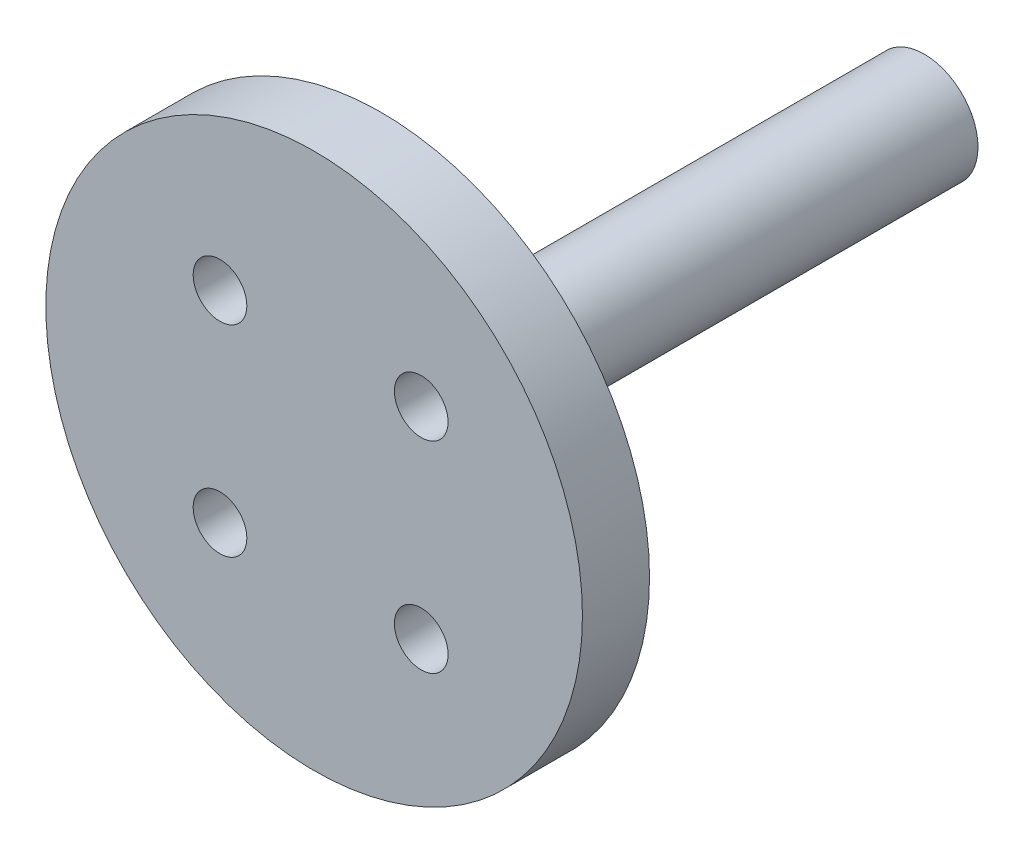
ISO-10303-21;
HEADER;
FILE_DESCRIPTION(('STEP AP214'),'2;1');
FILE_NAME('part.step','',(''),(''),'','','');
FILE_SCHEMA(('AUTOMOTIVE_DESIGN { 1 0 10303 214 1 1 1 1 }'));
ENDSEC;
DATA;
#1=APPLICATION_CONTEXT('core data for automotive mechanical design processes');
#2=APPLICATION_PROTOCOL_DEFINITION('international standard','automotive_design',2000,#1);
#3=PRODUCT_CONTEXT('',#1,'mechanical');
#4=PRODUCT('Part','Part','',(#3));
#5=PRODUCT_RELATED_PRODUCT_CATEGORY('part','',(#4));
#6=PRODUCT_DEFINITION_FORMATION('','',#4);
#7=PRODUCT_DEFINITION_CONTEXT('part definition',#1,'design');
#8=PRODUCT_DEFINITION('design','',#6,#7);
#9=PRODUCT_DEFINITION_SHAPE('','',#8);
#10=(LENGTH_UNIT() NAMED_UNIT(*) SI_UNIT(.MILLI.,.METRE.));
#11=(NAMED_UNIT(*) PLANE_ANGLE_UNIT() SI_UNIT($,.RADIAN.));
#12=(NAMED_UNIT(*) SI_UNIT($,.STERADIAN.) SOLID_ANGLE_UNIT());
#13=UNCERTAINTY_MEASURE_WITH_UNIT(LENGTH_MEASURE(1.E-05),#10,'distance_accuracy_value','');
#14=(GEOMETRIC_REPRESENTATION_CONTEXT(3) GLOBAL_UNCERTAINTY_ASSIGNED_CONTEXT((#13)) GLOBAL_UNIT_ASSIGNED_CONTEXT((#10,
#11,#12)) REPRESENTATION_CONTEXT('',''));
#15=CARTESIAN_POINT('',(0.,0.,0.));
#16=DIRECTION('',(0.,0.,1.));
#17=DIRECTION('',(1.,0.,0.));
#18=AXIS2_PLACEMENT_3D('',#15,#16,#17);
#19=CARTESIAN_POINT('',(-0.483808041547805,0.,5.));
#20=DIRECTION('',(0.,0.,-1.));
#21=DIRECTION('',(-1.,0.,0.));
#22=AXIS2_PLACEMENT_3D('',#19,#20,#21);
#23=CYLINDRICAL_SURFACE('',#22,20.);
#24=CARTESIAN_POINT('',(-0.483808041547805,0.,5.));
#25=DIRECTION('',(0.,0.,1.));
#26=DIRECTION('',(1.,0.,0.));
#27=AXIS2_PLACEMENT_3D('',#24,#25,#26);
#28=CIRCLE('',#27,20.);
#29=CARTESIAN_POINT('',(19.5161919584522,0.,5.));
#30=VERTEX_POINT('',#29);
#31=EDGE_CURVE('E37',#30,#30,#28,.T.);
#32=ORIENTED_EDGE('',*,*,#31,.F.);
#33=EDGE_LOOP('',(#32));
#34=FACE_BOUND('',#33,.T.);
#35=CARTESIAN_POINT('',(-0.483808041547805,0.,0.));
#36=DIRECTION('',(0.,0.,1.));
#37=DIRECTION('',(1.,0.,0.));
#38=AXIS2_PLACEMENT_3D('',#35,#36,#37);
#39=CIRCLE('',#38,20.);
#40=CARTESIAN_POINT('',(19.5161919584522,0.,0.));
#41=VERTEX_POINT('',#40);
#42=EDGE_CURVE('E41',#41,#41,#39,.T.);
#43=ORIENTED_EDGE('',*,*,#42,.T.);
#44=EDGE_LOOP('',(#43));
#45=FACE_BOUND('',#44,.T.);
#46=ADVANCED_FACE('F31',(#34,#45),#23,.T.);
#47=CARTESIAN_POINT('',(-0.483808041547805,0.,5.));
#48=DIRECTION('',(0.,0.,1.));
#49=DIRECTION('',(1.,0.,0.));
#50=AXIS2_PLACEMENT_3D('',#47,#48,#49);
#51=PLANE('',#50);
#52=CARTESIAN_POINT('',(7.5,-7.5,5.));
#53=DIRECTION('',(0.,0.,1.));
#54=DIRECTION('',(1.,0.,0.));
#55=AXIS2_PLACEMENT_3D('',#52,#53,#54);
#56=CIRCLE('',#55,2.);
#57=CARTESIAN_POINT('',(9.5,-7.5,5.));
#58=VERTEX_POINT('',#57);
#59=EDGE_CURVE('E46',#58,#58,#56,.T.);
#60=ORIENTED_EDGE('',*,*,#59,.F.);
#61=EDGE_LOOP('',(#60));
#62=FACE_BOUND('',#61,.T.);
#63=CARTESIAN_POINT('',(-7.5,-7.5,5.));
#64=DIRECTION('',(0.,0.,1.));
#65=DIRECTION('',(1.,0.,0.));
#66=AXIS2_PLACEMENT_3D('',#63,#64,#65);
#67=CIRCLE('',#66,2.);
#68=CARTESIAN_POINT('',(-5.5,-7.5,5.));
#69=VERTEX_POINT('',#68);
#70=EDGE_CURVE('E50',#69,#69,#67,.T.);
#71=ORIENTED_EDGE('',*,*,#70,.F.);
#72=EDGE_LOOP('',(#71));
#73=FACE_BOUND('',#72,.T.);
#74=CARTESIAN_POINT('',(-7.5,7.5,5.));
#75=DIRECTION('',(0.,0.,1.));
#76=DIRECTION('',(1.,0.,0.));
#77=AXIS2_PLACEMENT_3D('',#74,#75,#76);
#78=CIRCLE('',#77,2.);
#79=CARTESIAN_POINT('',(-5.5,7.5,5.));
#80=VERTEX_POINT('',#79);
#81=EDGE_CURVE('E53',#80,#80,#78,.T.);
#82=ORIENTED_EDGE('',*,*,#81,.F.);
#83=EDGE_LOOP('',(#82));
#84=FACE_BOUND('',#83,.T.);
#85=CARTESIAN_POINT('',(7.5,7.5,5.));
#86=DIRECTION('',(0.,0.,1.));
#87=DIRECTION('',(1.,0.,0.));
#88=AXIS2_PLACEMENT_3D('',#85,#86,#87);
#89=CIRCLE('',#88,2.);
#90=CARTESIAN_POINT('',(9.5,7.5,5.));
#91=VERTEX_POINT('',#90);
#92=EDGE_CURVE('E56',#91,#91,#89,.T.);
#93=ORIENTED_EDGE('',*,*,#92,.F.);
#94=EDGE_LOOP('',(#93));
#95=FACE_BOUND('',#94,.T.);
#96=ORIENTED_EDGE('',*,*,#31,.T.);
#97=EDGE_LOOP('',(#96));
#98=FACE_BOUND('',#97,.T.);
#99=ADVANCED_FACE('F107',(#62,#73,#84,#95,#98),#51,.T.);
#100=CARTESIAN_POINT('',(-0.483808041547805,0.,0.));
#101=DIRECTION('',(0.,0.,1.));
#102=DIRECTION('',(1.,0.,0.));
#103=AXIS2_PLACEMENT_3D('',#100,#101,#102);
#104=PLANE('',#103);
#105=CARTESIAN_POINT('',(0.,0.,0.));
#106=DIRECTION('',(0.,0.,1.));
#107=DIRECTION('',(1.,0.,0.));
#108=AXIS2_PLACEMENT_3D('',#105,#106,#107);
#109=CIRCLE('',#108,4.);
#110=CARTESIAN_POINT('',(4.,0.,0.));
#111=VERTEX_POINT('',#110);
#112=EDGE_CURVE('E10',#111,#111,#109,.F.);
#113=ORIENTED_EDGE('',*,*,#112,.F.);
#114=EDGE_LOOP('',(#113));
#115=FACE_BOUND('',#114,.T.);
#116=CARTESIAN_POINT('',(7.5,-7.5,0.));
#117=DIRECTION('',(0.,0.,-1.));
#118=DIRECTION('',(-1.,0.,0.));
#119=AXIS2_PLACEMENT_3D('',#116,#117,#118);
#120=CIRCLE('',#119,2.);
#121=CARTESIAN_POINT('',(5.5,-7.5,0.));
#122=VERTEX_POINT('',#121);
#123=EDGE_CURVE('E63',#122,#122,#120,.T.);
#124=ORIENTED_EDGE('',*,*,#123,.F.);
#125=EDGE_LOOP('',(#124));
#126=FACE_BOUND('',#125,.T.);
#127=CARTESIAN_POINT('',(-7.5,-7.5,0.));
#128=DIRECTION('',(0.,0.,-1.));
#129=DIRECTION('',(-1.,0.,0.));
#130=AXIS2_PLACEMENT_3D('',#127,#128,#129);
#131=CIRCLE('',#130,2.);
#132=CARTESIAN_POINT('',(-9.5,-7.5,0.));
#133=VERTEX_POINT('',#132);
#134=EDGE_CURVE('E66',#133,#133,#131,.T.);
#135=ORIENTED_EDGE('',*,*,#134,.F.);
#136=EDGE_LOOP('',(#135));
#137=FACE_BOUND('',#136,.T.);
#138=CARTESIAN_POINT('',(-7.5,7.5,0.));
#139=DIRECTION('',(0.,0.,-1.));
#140=DIRECTION('',(-1.,0.,0.));
#141=AXIS2_PLACEMENT_3D('',#138,#139,#140);
#142=CIRCLE('',#141,2.);
#143=CARTESIAN_POINT('',(-9.5,7.5,0.));
#144=VERTEX_POINT('',#143);
#145=EDGE_CURVE('E62',#144,#144,#142,.T.);
#146=ORIENTED_EDGE('',*,*,#145,.F.);
#147=EDGE_LOOP('',(#146));
#148=FACE_BOUND('',#147,.T.);
#149=CARTESIAN_POINT('',(7.5,7.5,0.));
#150=DIRECTION('',(0.,0.,-1.));
#151=DIRECTION('',(-1.,0.,0.));
#152=AXIS2_PLACEMENT_3D('',#149,#150,#151);
#153=CIRCLE('',#152,2.);
#154=CARTESIAN_POINT('',(5.5,7.5,0.));
#155=VERTEX_POINT('',#154);
#156=EDGE_CURVE('E59',#155,#155,#153,.T.);
#157=ORIENTED_EDGE('',*,*,#156,.F.);
#158=EDGE_LOOP('',(#157));
#159=FACE_BOUND('',#158,.T.);
#160=ORIENTED_EDGE('',*,*,#42,.F.);
#161=EDGE_LOOP('',(#160));
#162=FACE_BOUND('',#161,.T.);
#163=ADVANCED_FACE('F112',(#115,#126,#137,#148,#159,#162),#104,.F.);
#164=CARTESIAN_POINT('',(7.5,7.5,30.));
#165=DIRECTION('',(0.,0.,-1.));
#166=DIRECTION('',(-1.,0.,0.));
#167=AXIS2_PLACEMENT_3D('',#164,#165,#166);
#168=CYLINDRICAL_SURFACE('',#167,2.);
#169=ORIENTED_EDGE('',*,*,#92,.T.);
#170=EDGE_LOOP('',(#169));
#171=FACE_BOUND('',#170,.T.);
#172=ORIENTED_EDGE('',*,*,#156,.T.);
#173=EDGE_LOOP('',(#172));
#174=FACE_BOUND('',#173,.T.);
#175=ADVANCED_FACE('F119',(#171,#174),#168,.F.);
#176=CARTESIAN_POINT('',(-7.5,7.5,30.));
#177=DIRECTION('',(0.,0.,-1.));
#178=DIRECTION('',(-1.,0.,0.));
#179=AXIS2_PLACEMENT_3D('',#176,#177,#178);
#180=CYLINDRICAL_SURFACE('',#179,2.);
#181=ORIENTED_EDGE('',*,*,#81,.T.);
#182=EDGE_LOOP('',(#181));
#183=FACE_BOUND('',#182,.T.);
#184=ORIENTED_EDGE('',*,*,#145,.T.);
#185=EDGE_LOOP('',(#184));
#186=FACE_BOUND('',#185,.T.);
#187=ADVANCED_FACE('F124',(#183,#186),#180,.F.);
#188=CARTESIAN_POINT('',(-7.5,-7.5,30.));
#189=DIRECTION('',(0.,0.,-1.));
#190=DIRECTION('',(-1.,0.,0.));
#191=AXIS2_PLACEMENT_3D('',#188,#189,#190);
#192=CYLINDRICAL_SURFACE('',#191,2.);
#193=ORIENTED_EDGE('',*,*,#70,.T.);
#194=EDGE_LOOP('',(#193));
#195=FACE_BOUND('',#194,.T.);
#196=ORIENTED_EDGE('',*,*,#134,.T.);
#197=EDGE_LOOP('',(#196));
#198=FACE_BOUND('',#197,.T.);
#199=ADVANCED_FACE('F102',(#195,#198),#192,.F.);
#200=CARTESIAN_POINT('',(7.5,-7.5,30.));
#201=DIRECTION('',(0.,0.,-1.));
#202=DIRECTION('',(-1.,0.,0.));
#203=AXIS2_PLACEMENT_3D('',#200,#201,#202);
#204=CYLINDRICAL_SURFACE('',#203,2.);
#205=ORIENTED_EDGE('',*,*,#59,.T.);
#206=EDGE_LOOP('',(#205));
#207=FACE_BOUND('',#206,.T.);
#208=ORIENTED_EDGE('',*,*,#123,.T.);
#209=EDGE_LOOP('',(#208));
#210=FACE_BOUND('',#209,.T.);
#211=ADVANCED_FACE('F97',(#207,#210),#204,.F.);
#212=CARTESIAN_POINT('',(0.,0.,-40.));
#213=DIRECTION('',(0.,0.,1.));
#214=DIRECTION('',(1.,0.,0.));
#215=AXIS2_PLACEMENT_3D('',#212,#213,#214);
#216=CYLINDRICAL_SURFACE('',#215,4.);
#217=CARTESIAN_POINT('',(0.,0.,-40.));
#218=DIRECTION('',(0.,0.,-1.));
#219=DIRECTION('',(-1.,0.,0.));
#220=AXIS2_PLACEMENT_3D('',#217,#218,#219);
#221=CIRCLE('',#220,4.);
#222=CARTESIAN_POINT('',(-4.,0.,-40.));
#223=VERTEX_POINT('',#222);
#224=EDGE_CURVE('E67',#223,#223,#221,.T.);
#225=ORIENTED_EDGE('',*,*,#224,.F.);
#226=EDGE_LOOP('',(#225));
#227=FACE_BOUND('',#226,.T.);
#228=ORIENTED_EDGE('',*,*,#112,.T.);
#229=EDGE_LOOP('',(#228));
#230=FACE_BOUND('',#229,.T.);
#231=ADVANCED_FACE('F92',(#227,#230),#216,.T.);
#232=CARTESIAN_POINT('',(0.,0.,-40.));
#233=DIRECTION('',(0.,0.,-1.));
#234=DIRECTION('',(-1.,0.,0.));
#235=AXIS2_PLACEMENT_3D('',#232,#233,#234);
#236=PLANE('',#235);
#237=CARTESIAN_POINT('',(0.,0.,-40.));
#238=DIRECTION('',(0.,0.,-1.));
#239=DIRECTION('',(-1.,0.,0.));
#240=AXIS2_PLACEMENT_3D('',#237,#238,#239);
#241=CIRCLE('',#240,2.5);
#242=CARTESIAN_POINT('',(-2.5,0.,-40.));
#243=VERTEX_POINT('',#242);
#244=EDGE_CURVE('E75',#243,#243,#241,.T.);
#245=ORIENTED_EDGE('',*,*,#244,.F.);
#246=EDGE_LOOP('',(#245));
#247=FACE_BOUND('',#246,.T.);
#248=ORIENTED_EDGE('',*,*,#224,.T.);
#249=EDGE_LOOP('',(#248));
#250=FACE_BOUND('',#249,.T.);
#251=ADVANCED_FACE('F86',(#247,#250),#236,.T.);
#252=CARTESIAN_POINT('',(0.,0.,-24.));
#253=DIRECTION('',(0.,0.,-1.));
#254=DIRECTION('',(-1.,0.,0.));
#255=AXIS2_PLACEMENT_3D('',#252,#253,#254);
#256=CYLINDRICAL_SURFACE('',#255,2.5);
#257=CARTESIAN_POINT('',(0.,0.,-24.));
#258=DIRECTION('',(0.,0.,-1.));
#259=DIRECTION('',(-1.,0.,0.));
#260=AXIS2_PLACEMENT_3D('',#257,#258,#259);
#261=CIRCLE('',#260,2.5);
#262=CARTESIAN_POINT('',(-2.5,0.,-24.));
#263=VERTEX_POINT('',#262);
#264=EDGE_CURVE('E74',#263,#263,#261,.T.);
#265=ORIENTED_EDGE('',*,*,#264,.F.);
#266=EDGE_LOOP('',(#265));
#267=FACE_BOUND('',#266,.T.);
#268=ORIENTED_EDGE('',*,*,#244,.T.);
#269=EDGE_LOOP('',(#268));
#270=FACE_BOUND('',#269,.T.);
#271=ADVANCED_FACE('F83',(#267,#270),#256,.F.);
#272=CARTESIAN_POINT('',(0.,0.,-24.));
#273=DIRECTION('',(0.,0.,-1.));
#274=DIRECTION('',(-1.,0.,0.));
#275=AXIS2_PLACEMENT_3D('',#272,#273,#274);
#276=PLANE('',#275);
#277=ORIENTED_EDGE('',*,*,#264,.T.);
#278=EDGE_LOOP('',(#277));
#279=FACE_BOUND('',#278,.T.);
#280=ADVANCED_FACE('F81',(#279),#276,.T.);
#281=CLOSED_SHELL('',(#46,#99,#163,#175,#187,#199,#211,#231,#251,#271,#280));
#282=MANIFOLD_SOLID_BREP('B2',#281);
#283=ADVANCED_BREP_SHAPE_REPRESENTATION('',(#18,#282),#14);
#284=SHAPE_DEFINITION_REPRESENTATION(#9,#283);
ENDSEC;
END-ISO-10303-21;
